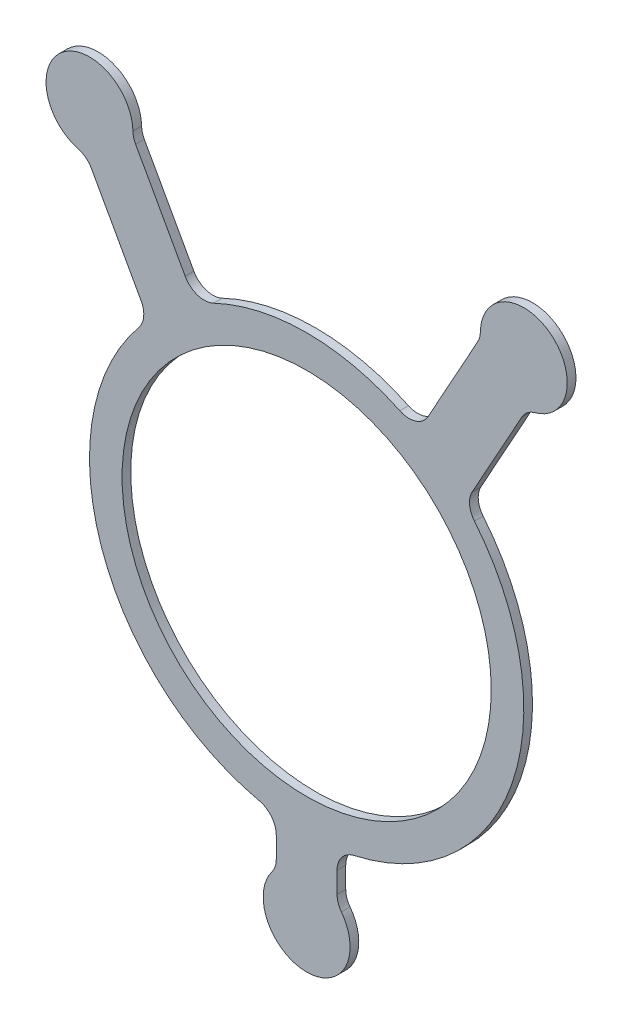
ISO-10303-21;
HEADER;
FILE_DESCRIPTION(('STEP AP214'),'2;1');
FILE_NAME('part.step','',(''),(''),'','','');
FILE_SCHEMA(('AUTOMOTIVE_DESIGN { 1 0 10303 214 1 1 1 1 }'));
ENDSEC;
DATA;
#1=APPLICATION_CONTEXT('core data for automotive mechanical design processes');
#2=APPLICATION_PROTOCOL_DEFINITION('international standard','automotive_design',2000,#1);
#3=PRODUCT_CONTEXT('',#1,'mechanical');
#4=PRODUCT('Part','Part','',(#3));
#5=PRODUCT_RELATED_PRODUCT_CATEGORY('part','',(#4));
#6=PRODUCT_DEFINITION_FORMATION('','',#4);
#7=PRODUCT_DEFINITION_CONTEXT('part definition',#1,'design');
#8=PRODUCT_DEFINITION('design','',#6,#7);
#9=PRODUCT_DEFINITION_SHAPE('','',#8);
#10=(LENGTH_UNIT() NAMED_UNIT(*) SI_UNIT(.MILLI.,.METRE.));
#11=(NAMED_UNIT(*) PLANE_ANGLE_UNIT() SI_UNIT($,.RADIAN.));
#12=(NAMED_UNIT(*) SI_UNIT($,.STERADIAN.) SOLID_ANGLE_UNIT());
#13=UNCERTAINTY_MEASURE_WITH_UNIT(LENGTH_MEASURE(1.E-05),#10,'distance_accuracy_value','');
#14=(GEOMETRIC_REPRESENTATION_CONTEXT(3) GLOBAL_UNCERTAINTY_ASSIGNED_CONTEXT((#13)) GLOBAL_UNIT_ASSIGNED_CONTEXT((#10,
#11,#12)) REPRESENTATION_CONTEXT('',''));
#15=CARTESIAN_POINT('',(0.,0.,0.));
#16=DIRECTION('',(0.,0.,1.));
#17=DIRECTION('',(1.,0.,0.));
#18=AXIS2_PLACEMENT_3D('',#15,#16,#17);
#19=CARTESIAN_POINT('',(-53.9762118068196,130.059986849951,2.54));
#20=DIRECTION('',(0.,0.,-1.));
#21=DIRECTION('',(-1.,0.,0.));
#22=AXIS2_PLACEMENT_3D('',#19,#20,#21);
#23=PLANE('',#22);
#24=CARTESIAN_POINT('',(-53.9762118068196,130.059986849951,2.54));
#25=DIRECTION('',(0.,0.,-1.));
#26=DIRECTION('',(-1.,0.,0.));
#27=AXIS2_PLACEMENT_3D('',#24,#25,#26);
#28=CIRCLE('',#27,6.34999999999999);
#29=CARTESIAN_POINT('',(-48.4212219063758,133.136443774071,2.54));
#30=VERTEX_POINT('',#29);
#31=CARTESIAN_POINT('',(-49.0692834607451,126.029533499956,2.54));
#32=VERTEX_POINT('',#31);
#33=EDGE_CURVE('E273',#30,#32,#28,.T.);
#34=ORIENTED_EDGE('',*,*,#33,.T.);
#35=CARTESIAN_POINT('',(0.,85.725,2.54));
#36=DIRECTION('',(0.,0.,1.));
#37=DIRECTION('',(1.,0.,0.));
#38=AXIS2_PLACEMENT_3D('',#35,#36,#37);
#39=CIRCLE('',#38,63.5);
#40=CARTESIAN_POINT('',(-13.8545454545455,23.7548332239784,2.54));
#41=VERTEX_POINT('',#40);
#42=EDGE_CURVE('E141',#32,#41,#39,.T.);
#43=ORIENTED_EDGE('',*,*,#42,.T.);
#44=CARTESIAN_POINT('',(-15.24,17.5578165463762,2.54));
#45=DIRECTION('',(0.,0.,-1.));
#46=DIRECTION('',(-1.,0.,0.));
#47=AXIS2_PLACEMENT_3D('',#44,#45,#46);
#48=CIRCLE('',#47,6.35);
#49=CARTESIAN_POINT('',(-8.89,17.5578165463762,2.54));
#50=VERTEX_POINT('',#49);
#51=EDGE_CURVE('E336',#41,#50,#48,.T.);
#52=ORIENTED_EDGE('',*,*,#51,.T.);
#53=DIRECTION('',(0.,-1.,0.));
#54=VECTOR('',#53,1.);
#55=CARTESIAN_POINT('',(-8.89,11.43,2.54));
#56=LINE('',#55,#54);
#57=CARTESIAN_POINT('',(-8.89,11.43,2.54));
#58=VERTEX_POINT('',#57);
#59=EDGE_CURVE('E355',#50,#58,#56,.T.);
#60=ORIENTED_EDGE('',*,*,#59,.T.);
#61=CARTESIAN_POINT('',(-15.24,11.43,2.54));
#62=DIRECTION('',(0.,0.,-1.));
#63=DIRECTION('',(-1.,0.,0.));
#64=AXIS2_PLACEMENT_3D('',#61,#62,#63);
#65=CIRCLE('',#64,6.35);
#66=CARTESIAN_POINT('',(-10.16,7.62,2.54));
#67=VERTEX_POINT('',#66);
#68=EDGE_CURVE('E352',#58,#67,#65,.T.);
#69=ORIENTED_EDGE('',*,*,#68,.T.);
#70=CARTESIAN_POINT('',(0.,0.,2.54));
#71=DIRECTION('',(0.,0.,1.));
#72=DIRECTION('',(1.,0.,0.));
#73=AXIS2_PLACEMENT_3D('',#70,#71,#72);
#74=CIRCLE('',#73,12.7);
#75=CARTESIAN_POINT('',(10.16,7.62,2.54));
#76=VERTEX_POINT('',#75);
#77=EDGE_CURVE('E354',#67,#76,#74,.T.);
#78=ORIENTED_EDGE('',*,*,#77,.T.);
#79=CARTESIAN_POINT('',(15.24,11.43,2.54));
#80=DIRECTION('',(0.,0.,-1.));
#81=DIRECTION('',(-1.,0.,0.));
#82=AXIS2_PLACEMENT_3D('',#79,#80,#81);
#83=CIRCLE('',#82,6.35);
#84=CARTESIAN_POINT('',(8.89,11.43,2.54));
#85=VERTEX_POINT('',#84);
#86=EDGE_CURVE('E357',#76,#85,#83,.T.);
#87=ORIENTED_EDGE('',*,*,#86,.T.);
#88=DIRECTION('',(0.,1.,0.));
#89=VECTOR('',#88,1.);
#90=CARTESIAN_POINT('',(8.89,11.43,2.54));
#91=LINE('',#90,#89);
#92=CARTESIAN_POINT('',(8.89,17.5578165463762,2.54));
#93=VERTEX_POINT('',#92);
#94=EDGE_CURVE('E363',#85,#93,#91,.T.);
#95=ORIENTED_EDGE('',*,*,#94,.T.);
#96=CARTESIAN_POINT('',(15.24,17.5578165463762,2.54));
#97=DIRECTION('',(0.,0.,-1.));
#98=DIRECTION('',(-1.,0.,0.));
#99=AXIS2_PLACEMENT_3D('',#96,#97,#98);
#100=CIRCLE('',#99,6.35);
#101=CARTESIAN_POINT('',(13.8545454545455,23.7548332239784,2.54));
#102=VERTEX_POINT('',#101);
#103=EDGE_CURVE('E365',#93,#102,#100,.T.);
#104=ORIENTED_EDGE('',*,*,#103,.T.);
#105=CARTESIAN_POINT('',(0.,85.725,2.54));
#106=DIRECTION('',(0.,0.,1.));
#107=DIRECTION('',(1.,0.,0.));
#108=AXIS2_PLACEMENT_3D('',#105,#106,#107);
#109=CIRCLE('',#108,63.5);
#110=CARTESIAN_POINT('',(49.0692834607453,126.029533499955,2.54));
#111=VERTEX_POINT('',#110);
#112=EDGE_CURVE('E367',#102,#111,#109,.T.);
#113=ORIENTED_EDGE('',*,*,#112,.T.);
#114=CARTESIAN_POINT('',(53.9762118068198,130.059986849951,2.54));
#115=DIRECTION('',(0.,0.,-1.));
#116=DIRECTION('',(-1.,0.,0.));
#117=AXIS2_PLACEMENT_3D('',#114,#115,#116);
#118=CIRCLE('',#117,6.34999999999999);
#119=CARTESIAN_POINT('',(48.4212219063759,133.136443774071,2.54));
#120=VERTEX_POINT('',#119);
#121=EDGE_CURVE('E369',#111,#120,#118,.T.);
#122=ORIENTED_EDGE('',*,*,#121,.T.);
#123=DIRECTION('',(0.484481405373256,0.874801559125014,0.));
#124=VECTOR('',#123,1.);
#125=CARTESIAN_POINT('',(62.9176901553753,159.31192313279,2.54));
#126=LINE('',#125,#124);
#127=CARTESIAN_POINT('',(62.9176901553753,159.31192313279,2.54));
#128=VERTEX_POINT('',#127);
#129=EDGE_CURVE('E371',#120,#128,#126,.T.);
#130=ORIENTED_EDGE('',*,*,#129,.T.);
#131=CARTESIAN_POINT('',(68.4726800558191,156.23546620867,2.54));
#132=DIRECTION('',(0.,0.,-1.));
#133=DIRECTION('',(-1.,0.,0.));
#134=AXIS2_PLACEMENT_3D('',#131,#132,#133);
#135=CIRCLE('',#134,6.35);
#136=CARTESIAN_POINT('',(66.8151200372129,162.36531080578,2.54));
#137=VERTEX_POINT('',#136);
#138=EDGE_CURVE('E373',#128,#137,#135,.T.);
#139=ORIENTED_EDGE('',*,*,#138,.T.);
#140=CARTESIAN_POINT('',(63.5000000000005,174.625,2.54));
#141=DIRECTION('',(0.,0.,1.));
#142=DIRECTION('',(-1.,0.,0.));
#143=AXIS2_PLACEMENT_3D('',#140,#141,#142);
#144=CIRCLE('',#143,12.7);
#145=CARTESIAN_POINT('',(50.8024647631299,174.875197738658,2.54));
#146=VERTEX_POINT('',#145);
#147=EDGE_CURVE('E375',#137,#146,#144,.T.);
#148=ORIENTED_EDGE('',*,*,#147,.T.);
#149=CARTESIAN_POINT('',(44.4536971446946,175.000296607987,2.54));
#150=DIRECTION('',(0.,0.,-1.));
#151=DIRECTION('',(1.,0.,0.));
#152=AXIS2_PLACEMENT_3D('',#149,#150,#151);
#153=CIRCLE('',#152,6.35);
#154=CARTESIAN_POINT('',(50.008687045138,171.923839683866,2.54));
#155=VERTEX_POINT('',#154);
#156=EDGE_CURVE('E377',#146,#155,#153,.T.);
#157=ORIENTED_EDGE('',*,*,#156,.T.);
#158=DIRECTION('',(-0.48448140537337,-0.87480155912495,0.));
#159=VECTOR('',#158,1.);
#160=CARTESIAN_POINT('',(50.008687045138,171.923839683866,2.54));
#161=LINE('',#160,#159);
#162=CARTESIAN_POINT('',(35.5122187961348,145.748360325148,2.54));
#163=VERTEX_POINT('',#162);
#164=EDGE_CURVE('E379',#155,#163,#161,.T.);
#165=ORIENTED_EDGE('',*,*,#164,.T.);
#166=CARTESIAN_POINT('',(29.9572288956914,148.824817249269,2.54));
#167=DIRECTION('',(0.,0.,-1.));
#168=DIRECTION('',(-1.,0.,0.));
#169=AXIS2_PLACEMENT_3D('',#166,#167,#168);
#170=CIRCLE('',#169,6.34999999999999);
#171=CARTESIAN_POINT('',(27.2338444506285,143.088470226608,2.54));
#172=VERTEX_POINT('',#171);
#173=EDGE_CURVE('E381',#163,#172,#170,.T.);
#174=ORIENTED_EDGE('',*,*,#173,.T.);
#175=CARTESIAN_POINT('',(0.,85.725,2.54));
#176=DIRECTION('',(0.,0.,1.));
#177=DIRECTION('',(1.,0.,0.));
#178=AXIS2_PLACEMENT_3D('',#175,#176,#177);
#179=CIRCLE('',#178,63.5);
#180=CARTESIAN_POINT('',(-27.2338444506317,143.088470226607,2.54));
#181=VERTEX_POINT('',#180);
#182=EDGE_CURVE('E383',#172,#181,#179,.T.);
#183=ORIENTED_EDGE('',*,*,#182,.T.);
#184=CARTESIAN_POINT('',(-29.9572288956949,148.824817249267,2.54));
#185=DIRECTION('',(0.,0.,-1.));
#186=DIRECTION('',(-1.,0.,0.));
#187=AXIS2_PLACEMENT_3D('',#184,#185,#186);
#188=CIRCLE('',#187,6.35);
#189=CARTESIAN_POINT('',(-35.5122187961387,145.748360325147,2.54));
#190=VERTEX_POINT('',#189);
#191=EDGE_CURVE('E385',#181,#190,#188,.T.);
#192=ORIENTED_EDGE('',*,*,#191,.T.);
#193=DIRECTION('',(-0.484481405373266,0.874801559125008,0.));
#194=VECTOR('',#193,1.);
#195=CARTESIAN_POINT('',(-50.0086870451384,171.923839683866,2.54));
#196=LINE('',#195,#194);
#197=CARTESIAN_POINT('',(-50.0086870451384,171.923839683866,2.54));
#198=VERTEX_POINT('',#197);
#199=EDGE_CURVE('E387',#190,#198,#196,.T.);
#200=ORIENTED_EDGE('',*,*,#199,.T.);
#201=CARTESIAN_POINT('',(-44.4536971446946,175.000296607986,2.54));
#202=DIRECTION('',(0.,0.,-1.));
#203=DIRECTION('',(-1.,0.,0.));
#204=AXIS2_PLACEMENT_3D('',#201,#202,#203);
#205=CIRCLE('',#204,6.34999999999999);
#206=CARTESIAN_POINT('',(-50.8024647631299,174.875197738658,2.54));
#207=VERTEX_POINT('',#206);
#208=EDGE_CURVE('E208',#198,#207,#205,.T.);
#209=ORIENTED_EDGE('',*,*,#208,.T.);
#210=CARTESIAN_POINT('',(-63.5000000000005,174.625,2.54));
#211=DIRECTION('',(0.,0.,1.));
#212=DIRECTION('',(1.,0.,0.));
#213=AXIS2_PLACEMENT_3D('',#210,#211,#212);
#214=CIRCLE('',#213,12.7);
#215=CARTESIAN_POINT('',(-66.815120037213,162.36531080578,2.54));
#216=VERTEX_POINT('',#215);
#217=EDGE_CURVE('E202',#207,#216,#214,.T.);
#218=ORIENTED_EDGE('',*,*,#217,.T.);
#219=CARTESIAN_POINT('',(-68.4726800558193,156.23546620867,2.54));
#220=DIRECTION('',(0.,0.,-1.));
#221=DIRECTION('',(-1.,0.,0.));
#222=AXIS2_PLACEMENT_3D('',#219,#220,#221);
#223=CIRCLE('',#222,6.35);
#224=CARTESIAN_POINT('',(-62.9176901553755,159.31192313279,2.54));
#225=VERTEX_POINT('',#224);
#226=EDGE_CURVE('E206',#216,#225,#223,.T.);
#227=ORIENTED_EDGE('',*,*,#226,.T.);
#228=DIRECTION('',(0.484481405373267,-0.874801559125008,0.));
#229=VECTOR('',#228,1.);
#230=CARTESIAN_POINT('',(-62.9176901553755,159.31192313279,2.54));
#231=LINE('',#230,#229);
#232=EDGE_CURVE('E50',#225,#30,#231,.T.);
#233=ORIENTED_EDGE('',*,*,#232,.T.);
#234=EDGE_LOOP('',(#34,#43,#52,#60,#69,#78,#87,#95,#104,#113,#122,#130,#139,#148,#157,#165,#174,
#183,#192,#200,#209,#218,#227,#233));
#235=FACE_BOUND('',#234,.T.);
#236=CARTESIAN_POINT('',(0.,85.725,2.54));
#237=DIRECTION('',(0.,0.,1.));
#238=DIRECTION('',(1.,0.,0.));
#239=AXIS2_PLACEMENT_3D('',#236,#237,#238);
#240=CIRCLE('',#239,53.975);
#241=CARTESIAN_POINT('',(53.975,85.725,2.54));
#242=VERTEX_POINT('',#241);
#243=EDGE_CURVE('E230',#242,#242,#240,.T.);
#244=ORIENTED_EDGE('',*,*,#243,.F.);
#245=EDGE_LOOP('',(#244));
#246=FACE_BOUND('',#245,.T.);
#247=ADVANCED_FACE('F33',(#235,#246),#23,.F.);
#248=CARTESIAN_POINT('',(-53.9762118068196,130.059986849951,0.));
#249=DIRECTION('',(0.,0.,-1.));
#250=DIRECTION('',(-1.,0.,0.));
#251=AXIS2_PLACEMENT_3D('',#248,#249,#250);
#252=PLANE('',#251);
#253=CARTESIAN_POINT('',(-53.9762118068196,130.059986849951,0.));
#254=DIRECTION('',(0.,0.,-1.));
#255=DIRECTION('',(-1.,0.,0.));
#256=AXIS2_PLACEMENT_3D('',#253,#254,#255);
#257=CIRCLE('',#256,6.34999999999999);
#258=CARTESIAN_POINT('',(-48.4212219063758,133.136443774071,0.));
#259=VERTEX_POINT('',#258);
#260=CARTESIAN_POINT('',(-49.0692834607451,126.029533499956,0.));
#261=VERTEX_POINT('',#260);
#262=EDGE_CURVE('E226',#259,#261,#257,.T.);
#263=ORIENTED_EDGE('',*,*,#262,.F.);
#264=DIRECTION('',(0.484481405373267,-0.874801559125008,0.));
#265=VECTOR('',#264,1.);
#266=CARTESIAN_POINT('',(-62.9176901553755,159.31192313279,0.));
#267=LINE('',#266,#265);
#268=CARTESIAN_POINT('',(-62.9176901553755,159.31192313279,0.));
#269=VERTEX_POINT('',#268);
#270=EDGE_CURVE('E133',#269,#259,#267,.T.);
#271=ORIENTED_EDGE('',*,*,#270,.F.);
#272=CARTESIAN_POINT('',(-68.4726800558193,156.23546620867,0.));
#273=DIRECTION('',(0.,0.,-1.));
#274=DIRECTION('',(-1.,0.,0.));
#275=AXIS2_PLACEMENT_3D('',#272,#273,#274);
#276=CIRCLE('',#275,6.35);
#277=CARTESIAN_POINT('',(-66.815120037213,162.36531080578,0.));
#278=VERTEX_POINT('',#277);
#279=EDGE_CURVE('E127',#278,#269,#276,.T.);
#280=ORIENTED_EDGE('',*,*,#279,.F.);
#281=CARTESIAN_POINT('',(-63.5000000000005,174.625,0.));
#282=DIRECTION('',(0.,0.,1.));
#283=DIRECTION('',(1.,0.,0.));
#284=AXIS2_PLACEMENT_3D('',#281,#282,#283);
#285=CIRCLE('',#284,12.7);
#286=CARTESIAN_POINT('',(-50.8024647631299,174.875197738658,0.));
#287=VERTEX_POINT('',#286);
#288=EDGE_CURVE('E216',#287,#278,#285,.T.);
#289=ORIENTED_EDGE('',*,*,#288,.F.);
#290=CARTESIAN_POINT('',(-44.4536971446946,175.000296607986,0.));
#291=DIRECTION('',(0.,0.,-1.));
#292=DIRECTION('',(-1.,0.,0.));
#293=AXIS2_PLACEMENT_3D('',#290,#291,#292);
#294=CIRCLE('',#293,6.34999999999999);
#295=CARTESIAN_POINT('',(-50.0086870451384,171.923839683866,0.));
#296=VERTEX_POINT('',#295);
#297=EDGE_CURVE('E268',#296,#287,#294,.T.);
#298=ORIENTED_EDGE('',*,*,#297,.F.);
#299=DIRECTION('',(-0.484481405373266,0.874801559125008,0.));
#300=VECTOR('',#299,1.);
#301=CARTESIAN_POINT('',(-50.0086870451384,171.923839683866,0.));
#302=LINE('',#301,#300);
#303=CARTESIAN_POINT('',(-35.5122187961387,145.748360325147,0.));
#304=VERTEX_POINT('',#303);
#305=EDGE_CURVE('E266',#304,#296,#302,.T.);
#306=ORIENTED_EDGE('',*,*,#305,.F.);
#307=CARTESIAN_POINT('',(-29.9572288956949,148.824817249267,0.));
#308=DIRECTION('',(0.,0.,-1.));
#309=DIRECTION('',(-1.,0.,0.));
#310=AXIS2_PLACEMENT_3D('',#307,#308,#309);
#311=CIRCLE('',#310,6.35);
#312=CARTESIAN_POINT('',(-27.2338444506317,143.088470226607,0.));
#313=VERTEX_POINT('',#312);
#314=EDGE_CURVE('E264',#313,#304,#311,.T.);
#315=ORIENTED_EDGE('',*,*,#314,.F.);
#316=CARTESIAN_POINT('',(0.,85.725,0.));
#317=DIRECTION('',(0.,0.,1.));
#318=DIRECTION('',(1.,0.,0.));
#319=AXIS2_PLACEMENT_3D('',#316,#317,#318);
#320=CIRCLE('',#319,63.5);
#321=CARTESIAN_POINT('',(27.2338444506285,143.088470226608,0.));
#322=VERTEX_POINT('',#321);
#323=EDGE_CURVE('E262',#322,#313,#320,.T.);
#324=ORIENTED_EDGE('',*,*,#323,.F.);
#325=CARTESIAN_POINT('',(29.9572288956914,148.824817249269,0.));
#326=DIRECTION('',(0.,0.,-1.));
#327=DIRECTION('',(-1.,0.,0.));
#328=AXIS2_PLACEMENT_3D('',#325,#326,#327);
#329=CIRCLE('',#328,6.34999999999999);
#330=CARTESIAN_POINT('',(35.5122187961348,145.748360325148,0.));
#331=VERTEX_POINT('',#330);
#332=EDGE_CURVE('E260',#331,#322,#329,.T.);
#333=ORIENTED_EDGE('',*,*,#332,.F.);
#334=DIRECTION('',(-0.48448140537337,-0.87480155912495,0.));
#335=VECTOR('',#334,1.);
#336=CARTESIAN_POINT('',(50.008687045138,171.923839683866,0.));
#337=LINE('',#336,#335);
#338=CARTESIAN_POINT('',(50.008687045138,171.923839683866,0.));
#339=VERTEX_POINT('',#338);
#340=EDGE_CURVE('E258',#339,#331,#337,.T.);
#341=ORIENTED_EDGE('',*,*,#340,.F.);
#342=CARTESIAN_POINT('',(44.4536971446946,175.000296607987,0.));
#343=DIRECTION('',(0.,0.,-1.));
#344=DIRECTION('',(1.,0.,0.));
#345=AXIS2_PLACEMENT_3D('',#342,#343,#344);
#346=CIRCLE('',#345,6.35);
#347=CARTESIAN_POINT('',(50.8024647631299,174.875197738658,0.));
#348=VERTEX_POINT('',#347);
#349=EDGE_CURVE('E256',#348,#339,#346,.T.);
#350=ORIENTED_EDGE('',*,*,#349,.F.);
#351=CARTESIAN_POINT('',(63.5000000000005,174.625,0.));
#352=DIRECTION('',(0.,0.,1.));
#353=DIRECTION('',(-1.,0.,0.));
#354=AXIS2_PLACEMENT_3D('',#351,#352,#353);
#355=CIRCLE('',#354,12.7);
#356=CARTESIAN_POINT('',(66.8151200372129,162.36531080578,0.));
#357=VERTEX_POINT('',#356);
#358=EDGE_CURVE('E254',#357,#348,#355,.T.);
#359=ORIENTED_EDGE('',*,*,#358,.F.);
#360=CARTESIAN_POINT('',(68.4726800558191,156.23546620867,0.));
#361=DIRECTION('',(0.,0.,-1.));
#362=DIRECTION('',(-1.,0.,0.));
#363=AXIS2_PLACEMENT_3D('',#360,#361,#362);
#364=CIRCLE('',#363,6.35);
#365=CARTESIAN_POINT('',(62.9176901553753,159.31192313279,0.));
#366=VERTEX_POINT('',#365);
#367=EDGE_CURVE('E252',#366,#357,#364,.T.);
#368=ORIENTED_EDGE('',*,*,#367,.F.);
#369=DIRECTION('',(0.484481405373256,0.874801559125014,0.));
#370=VECTOR('',#369,1.);
#371=CARTESIAN_POINT('',(62.9176901553753,159.31192313279,0.));
#372=LINE('',#371,#370);
#373=CARTESIAN_POINT('',(48.4212219063759,133.136443774071,0.));
#374=VERTEX_POINT('',#373);
#375=EDGE_CURVE('E250',#374,#366,#372,.T.);
#376=ORIENTED_EDGE('',*,*,#375,.F.);
#377=CARTESIAN_POINT('',(53.9762118068198,130.059986849951,0.));
#378=DIRECTION('',(0.,0.,-1.));
#379=DIRECTION('',(-1.,0.,0.));
#380=AXIS2_PLACEMENT_3D('',#377,#378,#379);
#381=CIRCLE('',#380,6.34999999999999);
#382=CARTESIAN_POINT('',(49.0692834607453,126.029533499955,0.));
#383=VERTEX_POINT('',#382);
#384=EDGE_CURVE('E248',#383,#374,#381,.T.);
#385=ORIENTED_EDGE('',*,*,#384,.F.);
#386=CARTESIAN_POINT('',(0.,85.725,0.));
#387=DIRECTION('',(0.,0.,1.));
#388=DIRECTION('',(1.,0.,0.));
#389=AXIS2_PLACEMENT_3D('',#386,#387,#388);
#390=CIRCLE('',#389,63.5);
#391=CARTESIAN_POINT('',(13.8545454545455,23.7548332239784,0.));
#392=VERTEX_POINT('',#391);
#393=EDGE_CURVE('E246',#392,#383,#390,.T.);
#394=ORIENTED_EDGE('',*,*,#393,.F.);
#395=CARTESIAN_POINT('',(15.24,17.5578165463762,0.));
#396=DIRECTION('',(0.,0.,-1.));
#397=DIRECTION('',(-1.,0.,0.));
#398=AXIS2_PLACEMENT_3D('',#395,#396,#397);
#399=CIRCLE('',#398,6.35);
#400=CARTESIAN_POINT('',(8.89,17.5578165463762,0.));
#401=VERTEX_POINT('',#400);
#402=EDGE_CURVE('E244',#401,#392,#399,.T.);
#403=ORIENTED_EDGE('',*,*,#402,.F.);
#404=DIRECTION('',(0.,1.,0.));
#405=VECTOR('',#404,1.);
#406=CARTESIAN_POINT('',(8.89,11.43,0.));
#407=LINE('',#406,#405);
#408=CARTESIAN_POINT('',(8.89,11.43,0.));
#409=VERTEX_POINT('',#408);
#410=EDGE_CURVE('E242',#409,#401,#407,.T.);
#411=ORIENTED_EDGE('',*,*,#410,.F.);
#412=CARTESIAN_POINT('',(15.24,11.43,0.));
#413=DIRECTION('',(0.,0.,-1.));
#414=DIRECTION('',(-1.,0.,0.));
#415=AXIS2_PLACEMENT_3D('',#412,#413,#414);
#416=CIRCLE('',#415,6.35);
#417=CARTESIAN_POINT('',(10.16,7.62,0.));
#418=VERTEX_POINT('',#417);
#419=EDGE_CURVE('E240',#418,#409,#416,.T.);
#420=ORIENTED_EDGE('',*,*,#419,.F.);
#421=CARTESIAN_POINT('',(0.,0.,0.));
#422=DIRECTION('',(0.,0.,1.));
#423=DIRECTION('',(1.,0.,0.));
#424=AXIS2_PLACEMENT_3D('',#421,#422,#423);
#425=CIRCLE('',#424,12.7);
#426=CARTESIAN_POINT('',(-10.16,7.62,0.));
#427=VERTEX_POINT('',#426);
#428=EDGE_CURVE('E238',#427,#418,#425,.T.);
#429=ORIENTED_EDGE('',*,*,#428,.F.);
#430=CARTESIAN_POINT('',(-15.24,11.43,0.));
#431=DIRECTION('',(0.,0.,-1.));
#432=DIRECTION('',(-1.,0.,0.));
#433=AXIS2_PLACEMENT_3D('',#430,#431,#432);
#434=CIRCLE('',#433,6.35);
#435=CARTESIAN_POINT('',(-8.89,11.43,0.));
#436=VERTEX_POINT('',#435);
#437=EDGE_CURVE('E236',#436,#427,#434,.T.);
#438=ORIENTED_EDGE('',*,*,#437,.F.);
#439=DIRECTION('',(0.,-1.,0.));
#440=VECTOR('',#439,1.);
#441=CARTESIAN_POINT('',(-8.89,11.43,0.));
#442=LINE('',#441,#440);
#443=CARTESIAN_POINT('',(-8.89,17.5578165463762,0.));
#444=VERTEX_POINT('',#443);
#445=EDGE_CURVE('E234',#444,#436,#442,.T.);
#446=ORIENTED_EDGE('',*,*,#445,.F.);
#447=CARTESIAN_POINT('',(-15.24,17.5578165463762,0.));
#448=DIRECTION('',(0.,0.,-1.));
#449=DIRECTION('',(-1.,0.,0.));
#450=AXIS2_PLACEMENT_3D('',#447,#448,#449);
#451=CIRCLE('',#450,6.35);
#452=CARTESIAN_POINT('',(-13.8545454545455,23.7548332239784,0.));
#453=VERTEX_POINT('',#452);
#454=EDGE_CURVE('E232',#453,#444,#451,.T.);
#455=ORIENTED_EDGE('',*,*,#454,.F.);
#456=CARTESIAN_POINT('',(0.,85.725,0.));
#457=DIRECTION('',(0.,0.,1.));
#458=DIRECTION('',(1.,0.,0.));
#459=AXIS2_PLACEMENT_3D('',#456,#457,#458);
#460=CIRCLE('',#459,63.5);
#461=EDGE_CURVE('E229',#261,#453,#460,.T.);
#462=ORIENTED_EDGE('',*,*,#461,.F.);
#463=EDGE_LOOP('',(#263,#271,#280,#289,#298,#306,#315,#324,#333,#341,#350,#359,#368,#376,#385,
#394,#403,#411,#420,#429,#438,#446,#455,#462));
#464=FACE_BOUND('',#463,.T.);
#465=CARTESIAN_POINT('',(0.,85.725,0.));
#466=DIRECTION('',(0.,0.,1.));
#467=DIRECTION('',(1.,0.,0.));
#468=AXIS2_PLACEMENT_3D('',#465,#466,#467);
#469=CIRCLE('',#468,53.975);
#470=CARTESIAN_POINT('',(53.975,85.725,0.));
#471=VERTEX_POINT('',#470);
#472=EDGE_CURVE('E690',#471,#471,#469,.T.);
#473=ORIENTED_EDGE('',*,*,#472,.T.);
#474=EDGE_LOOP('',(#473));
#475=FACE_BOUND('',#474,.T.);
#476=ADVANCED_FACE('F340',(#464,#475),#252,.T.);
#477=CARTESIAN_POINT('',(-53.9762118068196,130.059986849951,2.54));
#478=DIRECTION('',(0.,0.,-1.));
#479=DIRECTION('',(-1.,0.,0.));
#480=AXIS2_PLACEMENT_3D('',#477,#478,#479);
#481=CYLINDRICAL_SURFACE('',#480,6.34999999999999);
#482=ORIENTED_EDGE('',*,*,#262,.T.);
#483=DIRECTION('',(0.,0.,-1.));
#484=VECTOR('',#483,1.);
#485=CARTESIAN_POINT('',(-49.0692834607451,126.029533499956,2.54));
#486=LINE('',#485,#484);
#487=EDGE_CURVE('E11',#32,#261,#486,.T.);
#488=ORIENTED_EDGE('',*,*,#487,.F.);
#489=ORIENTED_EDGE('',*,*,#33,.F.);
#490=DIRECTION('',(0.,0.,-1.));
#491=VECTOR('',#490,1.);
#492=CARTESIAN_POINT('',(-48.4212219063758,133.136443774071,2.54));
#493=LINE('',#492,#491);
#494=EDGE_CURVE('E222',#30,#259,#493,.T.);
#495=ORIENTED_EDGE('',*,*,#494,.T.);
#496=EDGE_LOOP('',(#482,#488,#489,#495));
#497=FACE_BOUND('',#496,.T.);
#498=ADVANCED_FACE('F35',(#497),#481,.F.);
#499=CARTESIAN_POINT('',(0.,85.725,2.54));
#500=DIRECTION('',(0.,0.,-1.));
#501=DIRECTION('',(-1.,0.,0.));
#502=AXIS2_PLACEMENT_3D('',#499,#500,#501);
#503=CYLINDRICAL_SURFACE('',#502,63.5);
#504=ORIENTED_EDGE('',*,*,#461,.T.);
#505=DIRECTION('',(0.,0.,-1.));
#506=VECTOR('',#505,1.);
#507=CARTESIAN_POINT('',(-13.8545454545455,23.7548332239784,2.54));
#508=LINE('',#507,#506);
#509=EDGE_CURVE('E42',#41,#453,#508,.T.);
#510=ORIENTED_EDGE('',*,*,#509,.F.);
#511=ORIENTED_EDGE('',*,*,#42,.F.);
#512=ORIENTED_EDGE('',*,*,#487,.T.);
#513=EDGE_LOOP('',(#504,#510,#511,#512));
#514=FACE_BOUND('',#513,.T.);
#515=ADVANCED_FACE('F421',(#514),#503,.T.);
#516=CARTESIAN_POINT('',(-15.24,17.5578165463762,2.54));
#517=DIRECTION('',(0.,0.,-1.));
#518=DIRECTION('',(-1.,0.,0.));
#519=AXIS2_PLACEMENT_3D('',#516,#517,#518);
#520=CYLINDRICAL_SURFACE('',#519,6.35);
#521=ORIENTED_EDGE('',*,*,#454,.T.);
#522=DIRECTION('',(0.,0.,-1.));
#523=VECTOR('',#522,1.);
#524=CARTESIAN_POINT('',(-8.89,17.5578165463762,2.54));
#525=LINE('',#524,#523);
#526=EDGE_CURVE('E328',#50,#444,#525,.T.);
#527=ORIENTED_EDGE('',*,*,#526,.F.);
#528=ORIENTED_EDGE('',*,*,#51,.F.);
#529=ORIENTED_EDGE('',*,*,#509,.T.);
#530=EDGE_LOOP('',(#521,#527,#528,#529));
#531=FACE_BOUND('',#530,.T.);
#532=ADVANCED_FACE('F334',(#531),#520,.F.);
#533=CARTESIAN_POINT('',(-8.89,11.43,2.54));
#534=DIRECTION('',(1.,0.,0.));
#535=DIRECTION('',(0.,0.,-1.));
#536=AXIS2_PLACEMENT_3D('',#533,#534,#535);
#537=PLANE('',#536);
#538=ORIENTED_EDGE('',*,*,#445,.T.);
#539=DIRECTION('',(0.,0.,-1.));
#540=VECTOR('',#539,1.);
#541=CARTESIAN_POINT('',(-8.89,11.43,2.54));
#542=LINE('',#541,#540);
#543=EDGE_CURVE('E325',#58,#436,#542,.T.);
#544=ORIENTED_EDGE('',*,*,#543,.F.);
#545=ORIENTED_EDGE('',*,*,#59,.F.);
#546=ORIENTED_EDGE('',*,*,#526,.T.);
#547=EDGE_LOOP('',(#538,#544,#545,#546));
#548=FACE_BOUND('',#547,.T.);
#549=ADVANCED_FACE('F346',(#548),#537,.F.);
#550=CARTESIAN_POINT('',(-15.24,11.43,2.54));
#551=DIRECTION('',(0.,0.,-1.));
#552=DIRECTION('',(-1.,0.,0.));
#553=AXIS2_PLACEMENT_3D('',#550,#551,#552);
#554=CYLINDRICAL_SURFACE('',#553,6.35);
#555=ORIENTED_EDGE('',*,*,#437,.T.);
#556=DIRECTION('',(0.,0.,-1.));
#557=VECTOR('',#556,1.);
#558=CARTESIAN_POINT('',(-10.16,7.62,2.54));
#559=LINE('',#558,#557);
#560=EDGE_CURVE('E322',#67,#427,#559,.T.);
#561=ORIENTED_EDGE('',*,*,#560,.F.);
#562=ORIENTED_EDGE('',*,*,#68,.F.);
#563=ORIENTED_EDGE('',*,*,#543,.T.);
#564=EDGE_LOOP('',(#555,#561,#562,#563));
#565=FACE_BOUND('',#564,.T.);
#566=ADVANCED_FACE('F350',(#565),#554,.F.);
#567=CARTESIAN_POINT('',(0.,0.,2.54));
#568=DIRECTION('',(0.,0.,-1.));
#569=DIRECTION('',(-1.,0.,0.));
#570=AXIS2_PLACEMENT_3D('',#567,#568,#569);
#571=CYLINDRICAL_SURFACE('',#570,12.7);
#572=ORIENTED_EDGE('',*,*,#428,.T.);
#573=DIRECTION('',(0.,0.,-1.));
#574=VECTOR('',#573,1.);
#575=CARTESIAN_POINT('',(10.16,7.62,2.54));
#576=LINE('',#575,#574);
#577=EDGE_CURVE('E319',#76,#418,#576,.T.);
#578=ORIENTED_EDGE('',*,*,#577,.F.);
#579=ORIENTED_EDGE('',*,*,#77,.F.);
#580=ORIENTED_EDGE('',*,*,#560,.T.);
#581=EDGE_LOOP('',(#572,#578,#579,#580));
#582=FACE_BOUND('',#581,.T.);
#583=ADVANCED_FACE('F434',(#582),#571,.T.);
#584=CARTESIAN_POINT('',(15.24,11.43,2.54));
#585=DIRECTION('',(0.,0.,-1.));
#586=DIRECTION('',(-1.,0.,0.));
#587=AXIS2_PLACEMENT_3D('',#584,#585,#586);
#588=CYLINDRICAL_SURFACE('',#587,6.35);
#589=ORIENTED_EDGE('',*,*,#419,.T.);
#590=DIRECTION('',(0.,0.,-1.));
#591=VECTOR('',#590,1.);
#592=CARTESIAN_POINT('',(8.89,11.43,2.54));
#593=LINE('',#592,#591);
#594=EDGE_CURVE('E316',#85,#409,#593,.T.);
#595=ORIENTED_EDGE('',*,*,#594,.F.);
#596=ORIENTED_EDGE('',*,*,#86,.F.);
#597=ORIENTED_EDGE('',*,*,#577,.T.);
#598=EDGE_LOOP('',(#589,#595,#596,#597));
#599=FACE_BOUND('',#598,.T.);
#600=ADVANCED_FACE('F437',(#599),#588,.F.);
#601=CARTESIAN_POINT('',(8.89,11.43,2.54));
#602=DIRECTION('',(-1.,0.,0.));
#603=DIRECTION('',(0.,0.,1.));
#604=AXIS2_PLACEMENT_3D('',#601,#602,#603);
#605=PLANE('',#604);
#606=ORIENTED_EDGE('',*,*,#410,.T.);
#607=DIRECTION('',(0.,0.,-1.));
#608=VECTOR('',#607,1.);
#609=CARTESIAN_POINT('',(8.89,17.5578165463762,2.54));
#610=LINE('',#609,#608);
#611=EDGE_CURVE('E313',#93,#401,#610,.T.);
#612=ORIENTED_EDGE('',*,*,#611,.F.);
#613=ORIENTED_EDGE('',*,*,#94,.F.);
#614=ORIENTED_EDGE('',*,*,#594,.T.);
#615=EDGE_LOOP('',(#606,#612,#613,#614));
#616=FACE_BOUND('',#615,.T.);
#617=ADVANCED_FACE('F441',(#616),#605,.F.);
#618=CARTESIAN_POINT('',(15.24,17.5578165463762,2.54));
#619=DIRECTION('',(0.,0.,-1.));
#620=DIRECTION('',(-1.,0.,0.));
#621=AXIS2_PLACEMENT_3D('',#618,#619,#620);
#622=CYLINDRICAL_SURFACE('',#621,6.35);
#623=ORIENTED_EDGE('',*,*,#402,.T.);
#624=DIRECTION('',(0.,0.,-1.));
#625=VECTOR('',#624,1.);
#626=CARTESIAN_POINT('',(13.8545454545455,23.7548332239784,2.54));
#627=LINE('',#626,#625);
#628=EDGE_CURVE('E310',#102,#392,#627,.T.);
#629=ORIENTED_EDGE('',*,*,#628,.F.);
#630=ORIENTED_EDGE('',*,*,#103,.F.);
#631=ORIENTED_EDGE('',*,*,#611,.T.);
#632=EDGE_LOOP('',(#623,#629,#630,#631));
#633=FACE_BOUND('',#632,.T.);
#634=ADVANCED_FACE('F445',(#633),#622,.F.);
#635=CARTESIAN_POINT('',(0.,85.725,2.54));
#636=DIRECTION('',(0.,0.,-1.));
#637=DIRECTION('',(-1.,0.,0.));
#638=AXIS2_PLACEMENT_3D('',#635,#636,#637);
#639=CYLINDRICAL_SURFACE('',#638,63.5);
#640=ORIENTED_EDGE('',*,*,#393,.T.);
#641=DIRECTION('',(0.,0.,-1.));
#642=VECTOR('',#641,1.);
#643=CARTESIAN_POINT('',(49.0692834607453,126.029533499955,2.54));
#644=LINE('',#643,#642);
#645=EDGE_CURVE('E307',#111,#383,#644,.T.);
#646=ORIENTED_EDGE('',*,*,#645,.F.);
#647=ORIENTED_EDGE('',*,*,#112,.F.);
#648=ORIENTED_EDGE('',*,*,#628,.T.);
#649=EDGE_LOOP('',(#640,#646,#647,#648));
#650=FACE_BOUND('',#649,.T.);
#651=ADVANCED_FACE('F449',(#650),#639,.T.);
#652=CARTESIAN_POINT('',(53.9762118068198,130.059986849951,2.54));
#653=DIRECTION('',(0.,0.,-1.));
#654=DIRECTION('',(-1.,0.,0.));
#655=AXIS2_PLACEMENT_3D('',#652,#653,#654);
#656=CYLINDRICAL_SURFACE('',#655,6.34999999999999);
#657=ORIENTED_EDGE('',*,*,#384,.T.);
#658=DIRECTION('',(0.,0.,-1.));
#659=VECTOR('',#658,1.);
#660=CARTESIAN_POINT('',(48.4212219063759,133.136443774071,2.54));
#661=LINE('',#660,#659);
#662=EDGE_CURVE('E304',#120,#374,#661,.T.);
#663=ORIENTED_EDGE('',*,*,#662,.F.);
#664=ORIENTED_EDGE('',*,*,#121,.F.);
#665=ORIENTED_EDGE('',*,*,#645,.T.);
#666=EDGE_LOOP('',(#657,#663,#664,#665));
#667=FACE_BOUND('',#666,.T.);
#668=ADVANCED_FACE('F453',(#667),#656,.F.);
#669=CARTESIAN_POINT('',(62.9176901553753,159.31192313279,2.54));
#670=DIRECTION('',(-0.874801559125014,0.484481405373256,0.));
#671=DIRECTION('',(-0.484481405373256,-0.874801559125014,0.));
#672=AXIS2_PLACEMENT_3D('',#669,#670,#671);
#673=PLANE('',#672);
#674=ORIENTED_EDGE('',*,*,#375,.T.);
#675=DIRECTION('',(0.,0.,-1.));
#676=VECTOR('',#675,1.);
#677=CARTESIAN_POINT('',(62.9176901553753,159.31192313279,2.54));
#678=LINE('',#677,#676);
#679=EDGE_CURVE('E301',#128,#366,#678,.T.);
#680=ORIENTED_EDGE('',*,*,#679,.F.);
#681=ORIENTED_EDGE('',*,*,#129,.F.);
#682=ORIENTED_EDGE('',*,*,#662,.T.);
#683=EDGE_LOOP('',(#674,#680,#681,#682));
#684=FACE_BOUND('',#683,.T.);
#685=ADVANCED_FACE('F457',(#684),#673,.F.);
#686=CARTESIAN_POINT('',(68.4726800558191,156.23546620867,2.54));
#687=DIRECTION('',(0.,0.,-1.));
#688=DIRECTION('',(-1.,0.,0.));
#689=AXIS2_PLACEMENT_3D('',#686,#687,#688);
#690=CYLINDRICAL_SURFACE('',#689,6.35);
#691=ORIENTED_EDGE('',*,*,#367,.T.);
#692=DIRECTION('',(0.,0.,-1.));
#693=VECTOR('',#692,1.);
#694=CARTESIAN_POINT('',(66.8151200372129,162.36531080578,2.54));
#695=LINE('',#694,#693);
#696=EDGE_CURVE('E298',#137,#357,#695,.T.);
#697=ORIENTED_EDGE('',*,*,#696,.F.);
#698=ORIENTED_EDGE('',*,*,#138,.F.);
#699=ORIENTED_EDGE('',*,*,#679,.T.);
#700=EDGE_LOOP('',(#691,#697,#698,#699));
#701=FACE_BOUND('',#700,.T.);
#702=ADVANCED_FACE('F461',(#701),#690,.F.);
#703=CARTESIAN_POINT('',(63.5000000000005,174.625,2.54));
#704=DIRECTION('',(0.,0.,-1.));
#705=DIRECTION('',(-1.,0.,0.));
#706=AXIS2_PLACEMENT_3D('',#703,#704,#705);
#707=CYLINDRICAL_SURFACE('',#706,12.7);
#708=ORIENTED_EDGE('',*,*,#358,.T.);
#709=DIRECTION('',(0.,0.,-1.));
#710=VECTOR('',#709,1.);
#711=CARTESIAN_POINT('',(50.8024647631299,174.875197738658,2.54));
#712=LINE('',#711,#710);
#713=EDGE_CURVE('E295',#146,#348,#712,.T.);
#714=ORIENTED_EDGE('',*,*,#713,.F.);
#715=ORIENTED_EDGE('',*,*,#147,.F.);
#716=ORIENTED_EDGE('',*,*,#696,.T.);
#717=EDGE_LOOP('',(#708,#714,#715,#716));
#718=FACE_BOUND('',#717,.T.);
#719=ADVANCED_FACE('F465',(#718),#707,.T.);
#720=CARTESIAN_POINT('',(44.4536971446946,175.000296607987,2.54));
#721=DIRECTION('',(0.,0.,-1.));
#722=DIRECTION('',(-1.,0.,0.));
#723=AXIS2_PLACEMENT_3D('',#720,#721,#722);
#724=CYLINDRICAL_SURFACE('',#723,6.35);
#725=ORIENTED_EDGE('',*,*,#349,.T.);
#726=DIRECTION('',(0.,0.,-1.));
#727=VECTOR('',#726,1.);
#728=CARTESIAN_POINT('',(50.008687045138,171.923839683866,2.54));
#729=LINE('',#728,#727);
#730=EDGE_CURVE('E292',#155,#339,#729,.T.);
#731=ORIENTED_EDGE('',*,*,#730,.F.);
#732=ORIENTED_EDGE('',*,*,#156,.F.);
#733=ORIENTED_EDGE('',*,*,#713,.T.);
#734=EDGE_LOOP('',(#725,#731,#732,#733));
#735=FACE_BOUND('',#734,.T.);
#736=ADVANCED_FACE('F469',(#735),#724,.F.);
#737=CARTESIAN_POINT('',(50.008687045138,171.923839683866,2.54));
#738=DIRECTION('',(0.87480155912495,-0.48448140537337,0.));
#739=DIRECTION('',(0.48448140537337,0.87480155912495,0.));
#740=AXIS2_PLACEMENT_3D('',#737,#738,#739);
#741=PLANE('',#740);
#742=ORIENTED_EDGE('',*,*,#340,.T.);
#743=DIRECTION('',(0.,0.,-1.));
#744=VECTOR('',#743,1.);
#745=CARTESIAN_POINT('',(35.5122187961348,145.748360325148,2.54));
#746=LINE('',#745,#744);
#747=EDGE_CURVE('E289',#163,#331,#746,.T.);
#748=ORIENTED_EDGE('',*,*,#747,.F.);
#749=ORIENTED_EDGE('',*,*,#164,.F.);
#750=ORIENTED_EDGE('',*,*,#730,.T.);
#751=EDGE_LOOP('',(#742,#748,#749,#750));
#752=FACE_BOUND('',#751,.T.);
#753=ADVANCED_FACE('F473',(#752),#741,.F.);
#754=CARTESIAN_POINT('',(29.9572288956914,148.824817249269,2.54));
#755=DIRECTION('',(0.,0.,-1.));
#756=DIRECTION('',(-1.,0.,0.));
#757=AXIS2_PLACEMENT_3D('',#754,#755,#756);
#758=CYLINDRICAL_SURFACE('',#757,6.34999999999999);
#759=ORIENTED_EDGE('',*,*,#332,.T.);
#760=DIRECTION('',(0.,0.,-1.));
#761=VECTOR('',#760,1.);
#762=CARTESIAN_POINT('',(27.2338444506285,143.088470226608,2.54));
#763=LINE('',#762,#761);
#764=EDGE_CURVE('E286',#172,#322,#763,.T.);
#765=ORIENTED_EDGE('',*,*,#764,.F.);
#766=ORIENTED_EDGE('',*,*,#173,.F.);
#767=ORIENTED_EDGE('',*,*,#747,.T.);
#768=EDGE_LOOP('',(#759,#765,#766,#767));
#769=FACE_BOUND('',#768,.T.);
#770=ADVANCED_FACE('F477',(#769),#758,.F.);
#771=CARTESIAN_POINT('',(0.,85.725,2.54));
#772=DIRECTION('',(0.,0.,-1.));
#773=DIRECTION('',(-1.,0.,0.));
#774=AXIS2_PLACEMENT_3D('',#771,#772,#773);
#775=CYLINDRICAL_SURFACE('',#774,63.5);
#776=ORIENTED_EDGE('',*,*,#323,.T.);
#777=DIRECTION('',(0.,0.,-1.));
#778=VECTOR('',#777,1.);
#779=CARTESIAN_POINT('',(-27.2338444506317,143.088470226607,2.54));
#780=LINE('',#779,#778);
#781=EDGE_CURVE('E283',#181,#313,#780,.T.);
#782=ORIENTED_EDGE('',*,*,#781,.F.);
#783=ORIENTED_EDGE('',*,*,#182,.F.);
#784=ORIENTED_EDGE('',*,*,#764,.T.);
#785=EDGE_LOOP('',(#776,#782,#783,#784));
#786=FACE_BOUND('',#785,.T.);
#787=ADVANCED_FACE('F481',(#786),#775,.T.);
#788=CARTESIAN_POINT('',(-29.9572288956949,148.824817249267,2.54));
#789=DIRECTION('',(0.,0.,-1.));
#790=DIRECTION('',(-1.,0.,0.));
#791=AXIS2_PLACEMENT_3D('',#788,#789,#790);
#792=CYLINDRICAL_SURFACE('',#791,6.35);
#793=ORIENTED_EDGE('',*,*,#314,.T.);
#794=DIRECTION('',(0.,0.,-1.));
#795=VECTOR('',#794,1.);
#796=CARTESIAN_POINT('',(-35.5122187961387,145.748360325147,2.54));
#797=LINE('',#796,#795);
#798=EDGE_CURVE('E280',#190,#304,#797,.T.);
#799=ORIENTED_EDGE('',*,*,#798,.F.);
#800=ORIENTED_EDGE('',*,*,#191,.F.);
#801=ORIENTED_EDGE('',*,*,#781,.T.);
#802=EDGE_LOOP('',(#793,#799,#800,#801));
#803=FACE_BOUND('',#802,.T.);
#804=ADVANCED_FACE('F485',(#803),#792,.F.);
#805=CARTESIAN_POINT('',(-50.0086870451384,171.923839683866,2.54));
#806=DIRECTION('',(-0.874801559125008,-0.484481405373266,0.));
#807=DIRECTION('',(0.484481405373266,-0.874801559125008,0.));
#808=AXIS2_PLACEMENT_3D('',#805,#806,#807);
#809=PLANE('',#808);
#810=ORIENTED_EDGE('',*,*,#305,.T.);
#811=DIRECTION('',(0.,0.,-1.));
#812=VECTOR('',#811,1.);
#813=CARTESIAN_POINT('',(-50.0086870451384,171.923839683866,2.54));
#814=LINE('',#813,#812);
#815=EDGE_CURVE('E277',#198,#296,#814,.T.);
#816=ORIENTED_EDGE('',*,*,#815,.F.);
#817=ORIENTED_EDGE('',*,*,#199,.F.);
#818=ORIENTED_EDGE('',*,*,#798,.T.);
#819=EDGE_LOOP('',(#810,#816,#817,#818));
#820=FACE_BOUND('',#819,.T.);
#821=ADVANCED_FACE('F393',(#820),#809,.F.);
#822=CARTESIAN_POINT('',(-44.4536971446946,175.000296607986,2.54));
#823=DIRECTION('',(0.,0.,-1.));
#824=DIRECTION('',(-1.,0.,0.));
#825=AXIS2_PLACEMENT_3D('',#822,#823,#824);
#826=CYLINDRICAL_SURFACE('',#825,6.34999999999999);
#827=ORIENTED_EDGE('',*,*,#297,.T.);
#828=DIRECTION('',(0.,0.,-1.));
#829=VECTOR('',#828,1.);
#830=CARTESIAN_POINT('',(-50.8024647631299,174.875197738658,2.54));
#831=LINE('',#830,#829);
#832=EDGE_CURVE('E217',#207,#287,#831,.T.);
#833=ORIENTED_EDGE('',*,*,#832,.F.);
#834=ORIENTED_EDGE('',*,*,#208,.F.);
#835=ORIENTED_EDGE('',*,*,#815,.T.);
#836=EDGE_LOOP('',(#827,#833,#834,#835));
#837=FACE_BOUND('',#836,.T.);
#838=ADVANCED_FACE('F397',(#837),#826,.F.);
#839=CARTESIAN_POINT('',(-63.5000000000005,174.625,2.54));
#840=DIRECTION('',(0.,0.,-1.));
#841=DIRECTION('',(-1.,0.,0.));
#842=AXIS2_PLACEMENT_3D('',#839,#840,#841);
#843=CYLINDRICAL_SURFACE('',#842,12.7);
#844=ORIENTED_EDGE('',*,*,#288,.T.);
#845=DIRECTION('',(0.,0.,-1.));
#846=VECTOR('',#845,1.);
#847=CARTESIAN_POINT('',(-66.815120037213,162.36531080578,2.54));
#848=LINE('',#847,#846);
#849=EDGE_CURVE('E213',#216,#278,#848,.T.);
#850=ORIENTED_EDGE('',*,*,#849,.F.);
#851=ORIENTED_EDGE('',*,*,#217,.F.);
#852=ORIENTED_EDGE('',*,*,#832,.T.);
#853=EDGE_LOOP('',(#844,#850,#851,#852));
#854=FACE_BOUND('',#853,.T.);
#855=ADVANCED_FACE('F214',(#854),#843,.T.);
#856=CARTESIAN_POINT('',(-68.4726800558193,156.23546620867,2.54));
#857=DIRECTION('',(0.,0.,-1.));
#858=DIRECTION('',(-1.,0.,0.));
#859=AXIS2_PLACEMENT_3D('',#856,#857,#858);
#860=CYLINDRICAL_SURFACE('',#859,6.35);
#861=ORIENTED_EDGE('',*,*,#279,.T.);
#862=DIRECTION('',(0.,0.,-1.));
#863=VECTOR('',#862,1.);
#864=CARTESIAN_POINT('',(-62.9176901553755,159.31192313279,2.54));
#865=LINE('',#864,#863);
#866=EDGE_CURVE('E218',#225,#269,#865,.T.);
#867=ORIENTED_EDGE('',*,*,#866,.F.);
#868=ORIENTED_EDGE('',*,*,#226,.F.);
#869=ORIENTED_EDGE('',*,*,#849,.T.);
#870=EDGE_LOOP('',(#861,#867,#868,#869));
#871=FACE_BOUND('',#870,.T.);
#872=ADVANCED_FACE('F220',(#871),#860,.F.);
#873=CARTESIAN_POINT('',(-62.9176901553755,159.31192313279,2.54));
#874=DIRECTION('',(0.874801559125008,0.484481405373267,0.));
#875=DIRECTION('',(-0.484481405373267,0.874801559125008,0.));
#876=AXIS2_PLACEMENT_3D('',#873,#874,#875);
#877=PLANE('',#876);
#878=ORIENTED_EDGE('',*,*,#270,.T.);
#879=ORIENTED_EDGE('',*,*,#494,.F.);
#880=ORIENTED_EDGE('',*,*,#232,.F.);
#881=ORIENTED_EDGE('',*,*,#866,.T.);
#882=EDGE_LOOP('',(#878,#879,#880,#881));
#883=FACE_BOUND('',#882,.T.);
#884=ADVANCED_FACE('F401',(#883),#877,.F.);
#885=CARTESIAN_POINT('',(0.,85.725,2.54));
#886=DIRECTION('',(0.,0.,-1.));
#887=DIRECTION('',(-1.,0.,0.));
#888=AXIS2_PLACEMENT_3D('',#885,#886,#887);
#889=CYLINDRICAL_SURFACE('',#888,53.975);
#890=ORIENTED_EDGE('',*,*,#243,.T.);
#891=EDGE_LOOP('',(#890));
#892=FACE_BOUND('',#891,.T.);
#893=ORIENTED_EDGE('',*,*,#472,.F.);
#894=EDGE_LOOP('',(#893));
#895=FACE_BOUND('',#894,.T.);
#896=ADVANCED_FACE('F403',(#892,#895),#889,.F.);
#897=CLOSED_SHELL('',(#247,#476,#498,#515,#532,#549,#566,#583,#600,#617,#634,#651,#668,#685,
#702,#719,#736,#753,#770,#787,#804,#821,#838,#855,#872,#884,#896));
#898=MANIFOLD_SOLID_BREP('B2',#897);
#899=ADVANCED_BREP_SHAPE_REPRESENTATION('',(#18,#898),#14);
#900=SHAPE_DEFINITION_REPRESENTATION(#9,#899);
ENDSEC;
END-ISO-10303-21;
